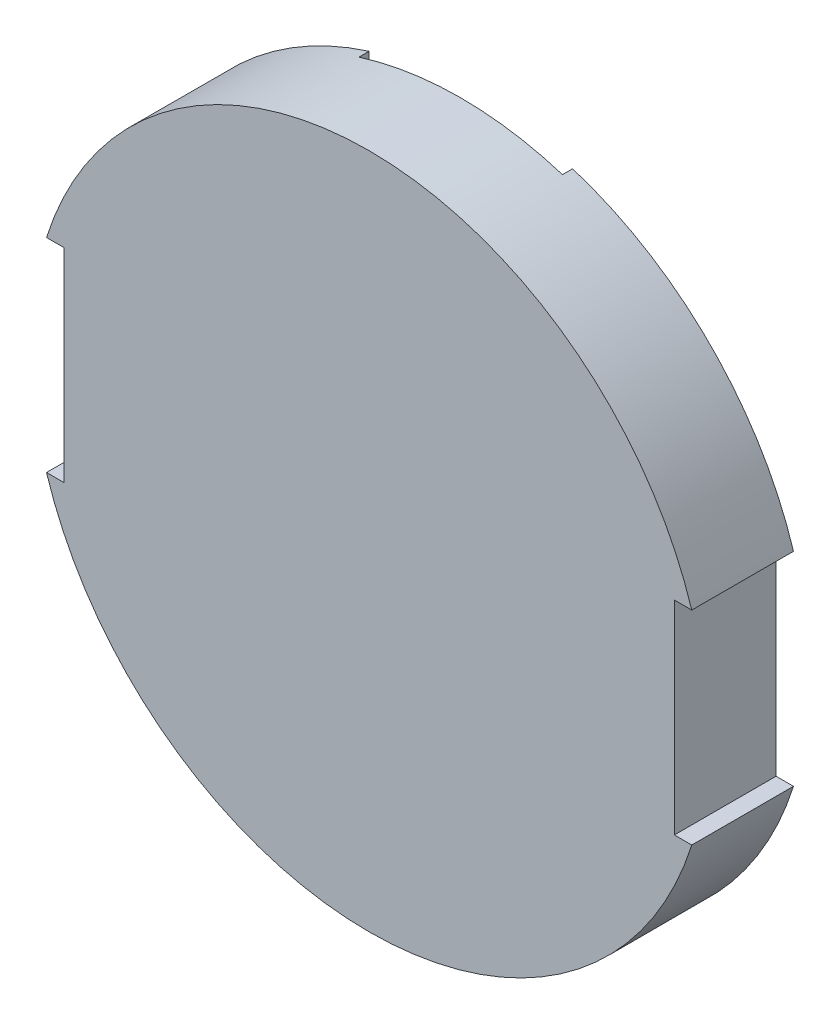
ISO-10303-21;
HEADER;
FILE_DESCRIPTION(('STEP AP214'),'2;1');
FILE_NAME('part.step','',(''),(''),'','','');
FILE_SCHEMA(('AUTOMOTIVE_DESIGN { 1 0 10303 214 1 1 1 1 }'));
ENDSEC;
DATA;
#1=APPLICATION_CONTEXT('core data for automotive mechanical design processes');
#2=APPLICATION_PROTOCOL_DEFINITION('international standard','automotive_design',2000,#1);
#3=PRODUCT_CONTEXT('',#1,'mechanical');
#4=PRODUCT('Part','Part','',(#3));
#5=PRODUCT_RELATED_PRODUCT_CATEGORY('part','',(#4));
#6=PRODUCT_DEFINITION_FORMATION('','',#4);
#7=PRODUCT_DEFINITION_CONTEXT('part definition',#1,'design');
#8=PRODUCT_DEFINITION('design','',#6,#7);
#9=PRODUCT_DEFINITION_SHAPE('','',#8);
#10=(LENGTH_UNIT() NAMED_UNIT(*) SI_UNIT(.MILLI.,.METRE.));
#11=(NAMED_UNIT(*) PLANE_ANGLE_UNIT() SI_UNIT($,.RADIAN.));
#12=(NAMED_UNIT(*) SI_UNIT($,.STERADIAN.) SOLID_ANGLE_UNIT());
#13=UNCERTAINTY_MEASURE_WITH_UNIT(LENGTH_MEASURE(1.E-05),#10,'distance_accuracy_value','');
#14=(GEOMETRIC_REPRESENTATION_CONTEXT(3) GLOBAL_UNCERTAINTY_ASSIGNED_CONTEXT((#13)) GLOBAL_UNIT_ASSIGNED_CONTEXT((#10,
#11,#12)) REPRESENTATION_CONTEXT('',''));
#15=CARTESIAN_POINT('',(0.,0.,0.));
#16=DIRECTION('',(0.,0.,1.));
#17=DIRECTION('',(1.,0.,0.));
#18=AXIS2_PLACEMENT_3D('',#15,#16,#17);
#19=CARTESIAN_POINT('',(0.,0.,0.));
#20=DIRECTION('',(0.,0.,-1.));
#21=DIRECTION('',(-1.,0.,0.));
#22=AXIS2_PLACEMENT_3D('',#19,#20,#21);
#23=PLANE('',#22);
#24=DIRECTION('',(0.,1.,0.));
#25=VECTOR('',#24,1.);
#26=CARTESIAN_POINT('',(-20.,63.4212109628948,0.));
#27=LINE('',#26,#25);
#28=CARTESIAN_POINT('',(-20.,-63.4212109628948,0.));
#29=VERTEX_POINT('',#28);
#30=CARTESIAN_POINT('',(-20.,63.4212109628948,0.));
#31=VERTEX_POINT('',#30);
#32=EDGE_CURVE('E207',#29,#31,#27,.T.);
#33=ORIENTED_EDGE('',*,*,#32,.F.);
#34=CARTESIAN_POINT('',(0.,0.,0.));
#35=DIRECTION('',(0.,0.,1.));
#36=DIRECTION('',(1.,0.,0.));
#37=AXIS2_PLACEMENT_3D('',#34,#35,#36);
#38=CIRCLE('',#37,66.5);
#39=CARTESIAN_POINT('',(-63.4212109628948,-20.,0.));
#40=VERTEX_POINT('',#39);
#41=EDGE_CURVE('E153',#40,#29,#38,.T.);
#42=ORIENTED_EDGE('',*,*,#41,.F.);
#43=DIRECTION('',(-1.,0.,0.));
#44=VECTOR('',#43,1.);
#45=CARTESIAN_POINT('',(-60.,-20.,0.));
#46=LINE('',#45,#44);
#47=CARTESIAN_POINT('',(-60.,-20.,0.));
#48=VERTEX_POINT('',#47);
#49=EDGE_CURVE('E150',#48,#40,#46,.T.);
#50=ORIENTED_EDGE('',*,*,#49,.F.);
#51=DIRECTION('',(0.,-1.,0.));
#52=VECTOR('',#51,1.);
#53=CARTESIAN_POINT('',(-60.,20.,0.));
#54=LINE('',#53,#52);
#55=CARTESIAN_POINT('',(-60.,20.,0.));
#56=VERTEX_POINT('',#55);
#57=EDGE_CURVE('E148',#56,#48,#54,.T.);
#58=ORIENTED_EDGE('',*,*,#57,.F.);
#59=DIRECTION('',(1.,0.,0.));
#60=VECTOR('',#59,1.);
#61=CARTESIAN_POINT('',(-63.4212109628947,20.,0.));
#62=LINE('',#61,#60);
#63=CARTESIAN_POINT('',(-63.4212109628947,20.,0.));
#64=VERTEX_POINT('',#63);
#65=EDGE_CURVE('E145',#64,#56,#62,.T.);
#66=ORIENTED_EDGE('',*,*,#65,.F.);
#67=CARTESIAN_POINT('',(0.,0.,0.));
#68=DIRECTION('',(0.,0.,1.));
#69=DIRECTION('',(-1.,0.,0.));
#70=AXIS2_PLACEMENT_3D('',#67,#68,#69);
#71=CIRCLE('',#70,66.5);
#72=EDGE_CURVE('E146',#31,#64,#71,.T.);
#73=ORIENTED_EDGE('',*,*,#72,.F.);
#74=EDGE_LOOP('',(#33,#42,#50,#58,#66,#73));
#75=FACE_BOUND('',#74,.T.);
#76=ADVANCED_FACE('F33',(#75),#23,.T.);
#77=CARTESIAN_POINT('',(0.,0.,20.));
#78=DIRECTION('',(0.,0.,-1.));
#79=DIRECTION('',(-1.,0.,0.));
#80=AXIS2_PLACEMENT_3D('',#77,#78,#79);
#81=CYLINDRICAL_SURFACE('',#80,66.5);
#82=CARTESIAN_POINT('',(0.,0.,2.));
#83=DIRECTION('',(0.,0.,-1.));
#84=DIRECTION('',(1.,0.,0.));
#85=AXIS2_PLACEMENT_3D('',#82,#83,#84);
#86=CIRCLE('',#85,66.5);
#87=CARTESIAN_POINT('',(-20.,63.4212109628948,2.));
#88=VERTEX_POINT('',#87);
#89=CARTESIAN_POINT('',(20.,63.4212109628948,2.));
#90=VERTEX_POINT('',#89);
#91=EDGE_CURVE('E210',#88,#90,#86,.T.);
#92=ORIENTED_EDGE('',*,*,#91,.F.);
#93=DIRECTION('',(0.,0.,-1.));
#94=VECTOR('',#93,1.);
#95=CARTESIAN_POINT('',(-20.,63.4212109628948,2.));
#96=LINE('',#95,#94);
#97=EDGE_CURVE('E204',#88,#31,#96,.T.);
#98=ORIENTED_EDGE('',*,*,#97,.T.);
#99=ORIENTED_EDGE('',*,*,#72,.T.);
#100=DIRECTION('',(0.,0.,-1.));
#101=VECTOR('',#100,1.);
#102=CARTESIAN_POINT('',(-63.4212109628947,20.,20.));
#103=LINE('',#102,#101);
#104=CARTESIAN_POINT('',(-63.4212109628947,20.,20.));
#105=VERTEX_POINT('',#104);
#106=EDGE_CURVE('E11',#105,#64,#103,.T.);
#107=ORIENTED_EDGE('',*,*,#106,.F.);
#108=CARTESIAN_POINT('',(0.,0.,20.));
#109=DIRECTION('',(0.,0.,1.));
#110=DIRECTION('',(-1.,0.,0.));
#111=AXIS2_PLACEMENT_3D('',#108,#109,#110);
#112=CIRCLE('',#111,66.5);
#113=CARTESIAN_POINT('',(63.4212109628948,20.,20.));
#114=VERTEX_POINT('',#113);
#115=EDGE_CURVE('E160',#114,#105,#112,.T.);
#116=ORIENTED_EDGE('',*,*,#115,.F.);
#117=DIRECTION('',(0.,0.,-1.));
#118=VECTOR('',#117,1.);
#119=CARTESIAN_POINT('',(63.4212109628948,20.,20.));
#120=LINE('',#119,#118);
#121=CARTESIAN_POINT('',(63.4212109628948,20.,0.));
#122=VERTEX_POINT('',#121);
#123=EDGE_CURVE('E138',#114,#122,#120,.T.);
#124=ORIENTED_EDGE('',*,*,#123,.T.);
#125=CARTESIAN_POINT('',(20.,63.4212109628948,0.));
#126=VERTEX_POINT('',#125);
#127=EDGE_CURVE('E142',#122,#126,#71,.T.);
#128=ORIENTED_EDGE('',*,*,#127,.T.);
#129=DIRECTION('',(0.,0.,-1.));
#130=VECTOR('',#129,1.);
#131=CARTESIAN_POINT('',(20.,63.4212109628948,2.));
#132=LINE('',#131,#130);
#133=EDGE_CURVE('E48',#90,#126,#132,.T.);
#134=ORIENTED_EDGE('',*,*,#133,.F.);
#135=EDGE_LOOP('',(#92,#98,#99,#107,#116,#124,#128,#134));
#136=FACE_BOUND('',#135,.T.);
#137=ADVANCED_FACE('F35',(#136),#81,.T.);
#138=CARTESIAN_POINT('',(-63.4212109628947,20.,20.));
#139=DIRECTION('',(0.,1.,0.));
#140=DIRECTION('',(0.,0.,1.));
#141=AXIS2_PLACEMENT_3D('',#138,#139,#140);
#142=PLANE('',#141);
#143=ORIENTED_EDGE('',*,*,#65,.T.);
#144=DIRECTION('',(0.,0.,-1.));
#145=VECTOR('',#144,1.);
#146=CARTESIAN_POINT('',(-60.,20.,20.));
#147=LINE('',#146,#145);
#148=CARTESIAN_POINT('',(-60.,20.,20.));
#149=VERTEX_POINT('',#148);
#150=EDGE_CURVE('E41',#149,#56,#147,.T.);
#151=ORIENTED_EDGE('',*,*,#150,.F.);
#152=DIRECTION('',(1.,0.,0.));
#153=VECTOR('',#152,1.);
#154=CARTESIAN_POINT('',(-63.4212109628947,20.,20.));
#155=LINE('',#154,#153);
#156=EDGE_CURVE('E98',#105,#149,#155,.T.);
#157=ORIENTED_EDGE('',*,*,#156,.F.);
#158=ORIENTED_EDGE('',*,*,#106,.T.);
#159=EDGE_LOOP('',(#143,#151,#157,#158));
#160=FACE_BOUND('',#159,.T.);
#161=ADVANCED_FACE('F248',(#160),#142,.F.);
#162=CARTESIAN_POINT('',(-60.,20.,20.));
#163=DIRECTION('',(1.,0.,0.));
#164=DIRECTION('',(0.,0.,-1.));
#165=AXIS2_PLACEMENT_3D('',#162,#163,#164);
#166=PLANE('',#165);
#167=ORIENTED_EDGE('',*,*,#57,.T.);
#168=DIRECTION('',(0.,0.,-1.));
#169=VECTOR('',#168,1.);
#170=CARTESIAN_POINT('',(-60.,-20.,20.));
#171=LINE('',#170,#169);
#172=CARTESIAN_POINT('',(-60.,-20.,20.));
#173=VERTEX_POINT('',#172);
#174=EDGE_CURVE('E167',#173,#48,#171,.T.);
#175=ORIENTED_EDGE('',*,*,#174,.F.);
#176=DIRECTION('',(0.,-1.,0.));
#177=VECTOR('',#176,1.);
#178=CARTESIAN_POINT('',(-60.,20.,20.));
#179=LINE('',#178,#177);
#180=EDGE_CURVE('E175',#149,#173,#179,.T.);
#181=ORIENTED_EDGE('',*,*,#180,.F.);
#182=ORIENTED_EDGE('',*,*,#150,.T.);
#183=EDGE_LOOP('',(#167,#175,#181,#182));
#184=FACE_BOUND('',#183,.T.);
#185=ADVANCED_FACE('F173',(#184),#166,.F.);
#186=CARTESIAN_POINT('',(-60.,-20.,20.));
#187=DIRECTION('',(0.,-1.,0.));
#188=DIRECTION('',(0.,0.,-1.));
#189=AXIS2_PLACEMENT_3D('',#186,#187,#188);
#190=PLANE('',#189);
#191=ORIENTED_EDGE('',*,*,#49,.T.);
#192=DIRECTION('',(0.,0.,-1.));
#193=VECTOR('',#192,1.);
#194=CARTESIAN_POINT('',(-63.4212109628948,-20.,20.));
#195=LINE('',#194,#193);
#196=CARTESIAN_POINT('',(-63.4212109628948,-20.,20.));
#197=VERTEX_POINT('',#196);
#198=EDGE_CURVE('E164',#197,#40,#195,.T.);
#199=ORIENTED_EDGE('',*,*,#198,.F.);
#200=DIRECTION('',(-1.,0.,0.));
#201=VECTOR('',#200,1.);
#202=CARTESIAN_POINT('',(-60.,-20.,20.));
#203=LINE('',#202,#201);
#204=EDGE_CURVE('E190',#173,#197,#203,.T.);
#205=ORIENTED_EDGE('',*,*,#204,.F.);
#206=ORIENTED_EDGE('',*,*,#174,.T.);
#207=EDGE_LOOP('',(#191,#199,#205,#206));
#208=FACE_BOUND('',#207,.T.);
#209=ADVANCED_FACE('F184',(#208),#190,.F.);
#210=CARTESIAN_POINT('',(0.,0.,20.));
#211=DIRECTION('',(0.,0.,-1.));
#212=DIRECTION('',(-1.,0.,0.));
#213=AXIS2_PLACEMENT_3D('',#210,#211,#212);
#214=CYLINDRICAL_SURFACE('',#213,66.5);
#215=ORIENTED_EDGE('',*,*,#41,.T.);
#216=DIRECTION('',(0.,0.,-1.));
#217=VECTOR('',#216,1.);
#218=CARTESIAN_POINT('',(-20.,-63.4212109628948,2.));
#219=LINE('',#218,#217);
#220=CARTESIAN_POINT('',(-20.,-63.4212109628948,2.));
#221=VERTEX_POINT('',#220);
#222=EDGE_CURVE('E201',#221,#29,#219,.T.);
#223=ORIENTED_EDGE('',*,*,#222,.F.);
#224=CARTESIAN_POINT('',(0.,0.,2.));
#225=DIRECTION('',(0.,0.,-1.));
#226=DIRECTION('',(-1.,0.,0.));
#227=AXIS2_PLACEMENT_3D('',#224,#225,#226);
#228=CIRCLE('',#227,66.5);
#229=CARTESIAN_POINT('',(20.,-63.4212109628948,2.));
#230=VERTEX_POINT('',#229);
#231=EDGE_CURVE('E215',#230,#221,#228,.T.);
#232=ORIENTED_EDGE('',*,*,#231,.F.);
#233=DIRECTION('',(0.,0.,-1.));
#234=VECTOR('',#233,1.);
#235=CARTESIAN_POINT('',(20.,-63.4212109628948,2.));
#236=LINE('',#235,#234);
#237=CARTESIAN_POINT('',(20.,-63.4212109628948,0.));
#238=VERTEX_POINT('',#237);
#239=EDGE_CURVE('E197',#230,#238,#236,.T.);
#240=ORIENTED_EDGE('',*,*,#239,.T.);
#241=CARTESIAN_POINT('',(63.4212109628948,-20.,0.));
#242=VERTEX_POINT('',#241);
#243=EDGE_CURVE('E152',#238,#242,#38,.T.);
#244=ORIENTED_EDGE('',*,*,#243,.T.);
#245=DIRECTION('',(0.,0.,-1.));
#246=VECTOR('',#245,1.);
#247=CARTESIAN_POINT('',(63.4212109628948,-20.,20.));
#248=LINE('',#247,#246);
#249=CARTESIAN_POINT('',(63.4212109628948,-20.,20.));
#250=VERTEX_POINT('',#249);
#251=EDGE_CURVE('E133',#250,#242,#248,.T.);
#252=ORIENTED_EDGE('',*,*,#251,.F.);
#253=CARTESIAN_POINT('',(0.,0.,20.));
#254=DIRECTION('',(0.,0.,1.));
#255=DIRECTION('',(1.,0.,0.));
#256=AXIS2_PLACEMENT_3D('',#253,#254,#255);
#257=CIRCLE('',#256,66.5);
#258=EDGE_CURVE('E121',#197,#250,#257,.T.);
#259=ORIENTED_EDGE('',*,*,#258,.F.);
#260=ORIENTED_EDGE('',*,*,#198,.T.);
#261=EDGE_LOOP('',(#215,#223,#232,#240,#244,#252,#259,#260));
#262=FACE_BOUND('',#261,.T.);
#263=ADVANCED_FACE('F187',(#262),#214,.T.);
#264=CARTESIAN_POINT('',(60.,-20.,20.));
#265=DIRECTION('',(0.,-1.,0.));
#266=DIRECTION('',(1.,0.,0.));
#267=AXIS2_PLACEMENT_3D('',#264,#265,#266);
#268=PLANE('',#267);
#269=DIRECTION('',(-1.,0.,0.));
#270=VECTOR('',#269,1.);
#271=CARTESIAN_POINT('',(60.,-20.,0.));
#272=LINE('',#271,#270);
#273=CARTESIAN_POINT('',(60.,-20.,0.));
#274=VERTEX_POINT('',#273);
#275=EDGE_CURVE('E130',#242,#274,#272,.T.);
#276=ORIENTED_EDGE('',*,*,#275,.T.);
#277=DIRECTION('',(0.,0.,-1.));
#278=VECTOR('',#277,1.);
#279=CARTESIAN_POINT('',(60.,-20.,20.));
#280=LINE('',#279,#278);
#281=CARTESIAN_POINT('',(60.,-20.,20.));
#282=VERTEX_POINT('',#281);
#283=EDGE_CURVE('E127',#282,#274,#280,.T.);
#284=ORIENTED_EDGE('',*,*,#283,.F.);
#285=DIRECTION('',(-1.,0.,0.));
#286=VECTOR('',#285,1.);
#287=CARTESIAN_POINT('',(60.,-20.,20.));
#288=LINE('',#287,#286);
#289=EDGE_CURVE('E114',#250,#282,#288,.T.);
#290=ORIENTED_EDGE('',*,*,#289,.F.);
#291=ORIENTED_EDGE('',*,*,#251,.T.);
#292=EDGE_LOOP('',(#276,#284,#290,#291));
#293=FACE_BOUND('',#292,.T.);
#294=ADVANCED_FACE('F128',(#293),#268,.F.);
#295=CARTESIAN_POINT('',(60.,20.,20.));
#296=DIRECTION('',(-1.,0.,0.));
#297=DIRECTION('',(0.,0.,1.));
#298=AXIS2_PLACEMENT_3D('',#295,#296,#297);
#299=PLANE('',#298);
#300=DIRECTION('',(0.,1.,0.));
#301=VECTOR('',#300,1.);
#302=CARTESIAN_POINT('',(60.,20.,0.));
#303=LINE('',#302,#301);
#304=CARTESIAN_POINT('',(60.,20.,0.));
#305=VERTEX_POINT('',#304);
#306=EDGE_CURVE('E157',#274,#305,#303,.T.);
#307=ORIENTED_EDGE('',*,*,#306,.T.);
#308=DIRECTION('',(0.,0.,-1.));
#309=VECTOR('',#308,1.);
#310=CARTESIAN_POINT('',(60.,20.,20.));
#311=LINE('',#310,#309);
#312=CARTESIAN_POINT('',(60.,20.,20.));
#313=VERTEX_POINT('',#312);
#314=EDGE_CURVE('E134',#313,#305,#311,.T.);
#315=ORIENTED_EDGE('',*,*,#314,.F.);
#316=DIRECTION('',(0.,1.,0.));
#317=VECTOR('',#316,1.);
#318=CARTESIAN_POINT('',(60.,20.,20.));
#319=LINE('',#318,#317);
#320=EDGE_CURVE('E118',#282,#313,#319,.T.);
#321=ORIENTED_EDGE('',*,*,#320,.F.);
#322=ORIENTED_EDGE('',*,*,#283,.T.);
#323=EDGE_LOOP('',(#307,#315,#321,#322));
#324=FACE_BOUND('',#323,.T.);
#325=ADVANCED_FACE('F136',(#324),#299,.F.);
#326=CARTESIAN_POINT('',(63.4212109628948,20.,20.));
#327=DIRECTION('',(0.,1.,0.));
#328=DIRECTION('',(-1.,0.,0.));
#329=AXIS2_PLACEMENT_3D('',#326,#327,#328);
#330=PLANE('',#329);
#331=DIRECTION('',(1.,0.,0.));
#332=VECTOR('',#331,1.);
#333=CARTESIAN_POINT('',(63.4212109628948,20.,0.));
#334=LINE('',#333,#332);
#335=EDGE_CURVE('E90',#305,#122,#334,.T.);
#336=ORIENTED_EDGE('',*,*,#335,.T.);
#337=ORIENTED_EDGE('',*,*,#123,.F.);
#338=DIRECTION('',(1.,0.,0.));
#339=VECTOR('',#338,1.);
#340=CARTESIAN_POINT('',(63.4212109628948,20.,20.));
#341=LINE('',#340,#339);
#342=EDGE_CURVE('E57',#313,#114,#341,.T.);
#343=ORIENTED_EDGE('',*,*,#342,.F.);
#344=ORIENTED_EDGE('',*,*,#314,.T.);
#345=EDGE_LOOP('',(#336,#337,#343,#344));
#346=FACE_BOUND('',#345,.T.);
#347=ADVANCED_FACE('F267',(#346),#330,.F.);
#348=CARTESIAN_POINT('',(0.,0.,20.));
#349=DIRECTION('',(0.,0.,-1.));
#350=DIRECTION('',(-1.,0.,0.));
#351=AXIS2_PLACEMENT_3D('',#348,#349,#350);
#352=PLANE('',#351);
#353=ORIENTED_EDGE('',*,*,#115,.T.);
#354=ORIENTED_EDGE('',*,*,#156,.T.);
#355=ORIENTED_EDGE('',*,*,#180,.T.);
#356=ORIENTED_EDGE('',*,*,#204,.T.);
#357=ORIENTED_EDGE('',*,*,#258,.T.);
#358=ORIENTED_EDGE('',*,*,#289,.T.);
#359=ORIENTED_EDGE('',*,*,#320,.T.);
#360=ORIENTED_EDGE('',*,*,#342,.T.);
#361=EDGE_LOOP('',(#353,#354,#355,#356,#357,#358,#359,#360));
#362=FACE_BOUND('',#361,.T.);
#363=ADVANCED_FACE('F116',(#362),#352,.F.);
#364=DIRECTION('',(0.,-1.,0.));
#365=VECTOR('',#364,1.);
#366=CARTESIAN_POINT('',(20.,63.4212109628948,0.));
#367=LINE('',#366,#365);
#368=EDGE_CURVE('E211',#126,#238,#367,.T.);
#369=ORIENTED_EDGE('',*,*,#368,.F.);
#370=ORIENTED_EDGE('',*,*,#127,.F.);
#371=ORIENTED_EDGE('',*,*,#335,.F.);
#372=ORIENTED_EDGE('',*,*,#306,.F.);
#373=ORIENTED_EDGE('',*,*,#275,.F.);
#374=ORIENTED_EDGE('',*,*,#243,.F.);
#375=EDGE_LOOP('',(#369,#370,#371,#372,#373,#374));
#376=FACE_BOUND('',#375,.T.);
#377=ADVANCED_FACE('F234',(#376),#23,.T.);
#378=CARTESIAN_POINT('',(-20.,63.4212109628948,2.));
#379=DIRECTION('',(-1.,0.,0.));
#380=DIRECTION('',(0.,0.,1.));
#381=AXIS2_PLACEMENT_3D('',#378,#379,#380);
#382=PLANE('',#381);
#383=ORIENTED_EDGE('',*,*,#32,.T.);
#384=ORIENTED_EDGE('',*,*,#97,.F.);
#385=DIRECTION('',(0.,1.,0.));
#386=VECTOR('',#385,1.);
#387=CARTESIAN_POINT('',(-20.,63.4212109628948,2.));
#388=LINE('',#387,#386);
#389=EDGE_CURVE('E198',#221,#88,#388,.T.);
#390=ORIENTED_EDGE('',*,*,#389,.F.);
#391=ORIENTED_EDGE('',*,*,#222,.T.);
#392=EDGE_LOOP('',(#383,#384,#390,#391));
#393=FACE_BOUND('',#392,.T.);
#394=ADVANCED_FACE('F245',(#393),#382,.F.);
#395=CARTESIAN_POINT('',(20.,63.4212109628948,2.));
#396=DIRECTION('',(1.,0.,0.));
#397=DIRECTION('',(0.,0.,-1.));
#398=AXIS2_PLACEMENT_3D('',#395,#396,#397);
#399=PLANE('',#398);
#400=ORIENTED_EDGE('',*,*,#368,.T.);
#401=ORIENTED_EDGE('',*,*,#239,.F.);
#402=DIRECTION('',(0.,-1.,0.));
#403=VECTOR('',#402,1.);
#404=CARTESIAN_POINT('',(20.,63.4212109628948,2.));
#405=LINE('',#404,#403);
#406=EDGE_CURVE('E218',#90,#230,#405,.T.);
#407=ORIENTED_EDGE('',*,*,#406,.F.);
#408=ORIENTED_EDGE('',*,*,#133,.T.);
#409=EDGE_LOOP('',(#400,#401,#407,#408));
#410=FACE_BOUND('',#409,.T.);
#411=ADVANCED_FACE('F238',(#410),#399,.F.);
#412=CARTESIAN_POINT('',(0.,0.,2.));
#413=DIRECTION('',(0.,0.,1.));
#414=DIRECTION('',(1.,0.,0.));
#415=AXIS2_PLACEMENT_3D('',#412,#413,#414);
#416=PLANE('',#415);
#417=ORIENTED_EDGE('',*,*,#91,.T.);
#418=ORIENTED_EDGE('',*,*,#406,.T.);
#419=ORIENTED_EDGE('',*,*,#231,.T.);
#420=ORIENTED_EDGE('',*,*,#389,.T.);
#421=EDGE_LOOP('',(#417,#418,#419,#420));
#422=FACE_BOUND('',#421,.T.);
#423=ADVANCED_FACE('F225',(#422),#416,.F.);
#424=CLOSED_SHELL('',(#76,#137,#161,#185,#209,#263,#294,#325,#347,#363,#377,#394,#411,#423));
#425=MANIFOLD_SOLID_BREP('B2',#424);
#426=ADVANCED_BREP_SHAPE_REPRESENTATION('',(#18,#425),#14);
#427=SHAPE_DEFINITION_REPRESENTATION(#9,#426);
ENDSEC;
END-ISO-10303-21;
